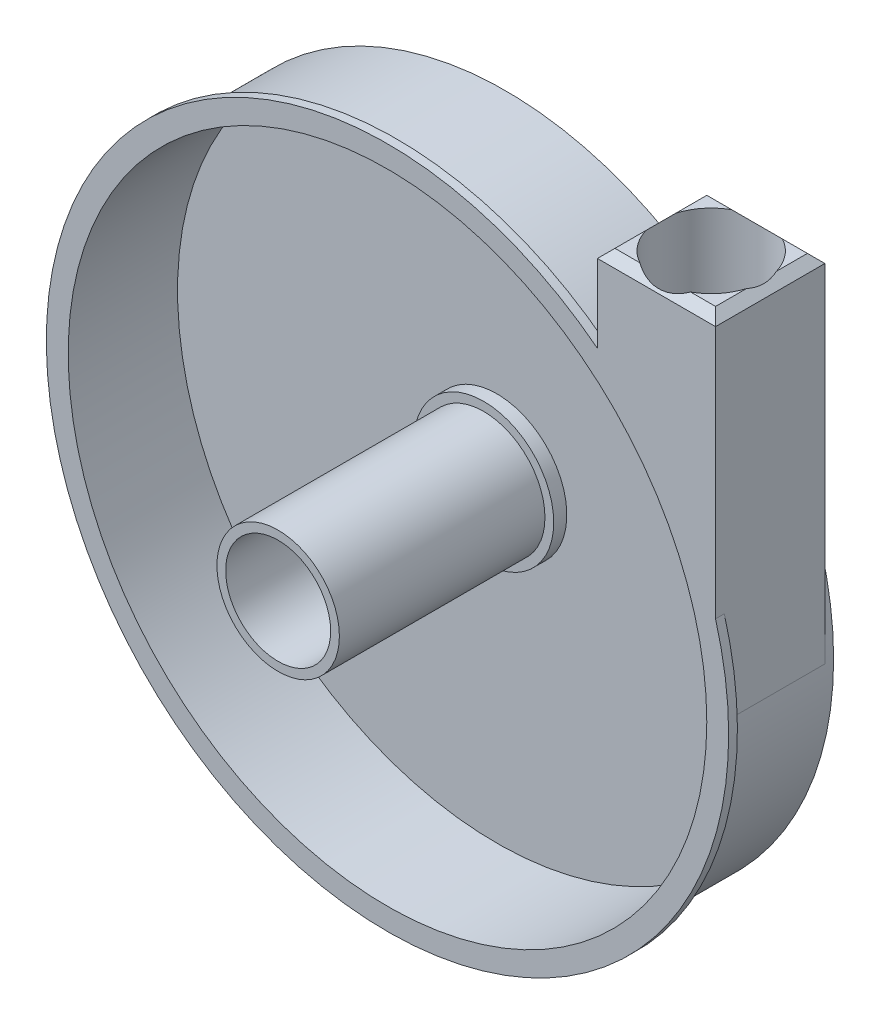
ISO-10303-21;
HEADER;
FILE_DESCRIPTION(('STEP AP214'),'2;1');
FILE_NAME('part.step','',(''),(''),'','','');
FILE_SCHEMA(('AUTOMOTIVE_DESIGN { 1 0 10303 214 1 1 1 1 }'));
ENDSEC;
DATA;
#1=APPLICATION_CONTEXT('core data for automotive mechanical design processes');
#2=APPLICATION_PROTOCOL_DEFINITION('international standard','automotive_design',2000,#1);
#3=PRODUCT_CONTEXT('',#1,'mechanical');
#4=PRODUCT('Part','Part','',(#3));
#5=PRODUCT_RELATED_PRODUCT_CATEGORY('part','',(#4));
#6=PRODUCT_DEFINITION_FORMATION('','',#4);
#7=PRODUCT_DEFINITION_CONTEXT('part definition',#1,'design');
#8=PRODUCT_DEFINITION('design','',#6,#7);
#9=PRODUCT_DEFINITION_SHAPE('','',#8);
#10=(LENGTH_UNIT() NAMED_UNIT(*) SI_UNIT(.MILLI.,.METRE.));
#11=(NAMED_UNIT(*) PLANE_ANGLE_UNIT() SI_UNIT($,.RADIAN.));
#12=(NAMED_UNIT(*) SI_UNIT($,.STERADIAN.) SOLID_ANGLE_UNIT());
#13=UNCERTAINTY_MEASURE_WITH_UNIT(LENGTH_MEASURE(1.E-05),#10,'distance_accuracy_value','');
#14=(GEOMETRIC_REPRESENTATION_CONTEXT(3) GLOBAL_UNCERTAINTY_ASSIGNED_CONTEXT((#13)) GLOBAL_UNIT_ASSIGNED_CONTEXT((#10,
#11,#12)) REPRESENTATION_CONTEXT('',''));
#15=CARTESIAN_POINT('',(0.,0.,0.));
#16=DIRECTION('',(0.,0.,1.));
#17=DIRECTION('',(1.,0.,0.));
#18=AXIS2_PLACEMENT_3D('',#15,#16,#17);
#19=CARTESIAN_POINT('',(0.,0.,25.));
#20=DIRECTION('',(0.,0.,-1.));
#21=DIRECTION('',(-1.,0.,0.));
#22=AXIS2_PLACEMENT_3D('',#19,#20,#21);
#23=CYLINDRICAL_SURFACE('',#22,75.);
#24=CARTESIAN_POINT('',(0.,0.,-2.));
#25=DIRECTION('',(0.,0.,-1.));
#26=DIRECTION('',(-1.,0.,0.));
#27=AXIS2_PLACEMENT_3D('',#24,#25,#26);
#28=CIRCLE('',#27,75.);
#29=CARTESIAN_POINT('',(-75.,0.,-2.));
#30=VERTEX_POINT('',#29);
#31=EDGE_CURVE('E477',#30,#30,#28,.T.);
#32=ORIENTED_EDGE('',*,*,#31,.F.);
#33=EDGE_LOOP('',(#32));
#34=FACE_BOUND('',#33,.T.);
#35=CARTESIAN_POINT('',(0.,0.,23.));
#36=DIRECTION('',(0.,0.,1.));
#37=DIRECTION('',(1.,0.,0.));
#38=AXIS2_PLACEMENT_3D('',#35,#36,#37);
#39=CIRCLE('',#38,75.);
#40=CARTESIAN_POINT('',(48.,57.6281181368957,23.));
#41=VERTEX_POINT('',#40);
#42=CARTESIAN_POINT('',(75.,0.,23.));
#43=VERTEX_POINT('',#42);
#44=EDGE_CURVE('E149',#41,#43,#39,.T.);
#45=ORIENTED_EDGE('',*,*,#44,.F.);
#46=DIRECTION('',(0.,0.,1.));
#47=VECTOR('',#46,1.);
#48=CARTESIAN_POINT('',(48.,57.6281181368956,-85.6539428203754));
#49=LINE('',#48,#47);
#50=CARTESIAN_POINT('',(48.,57.6281181368956,0.));
#51=VERTEX_POINT('',#50);
#52=EDGE_CURVE('E179',#51,#41,#49,.T.);
#53=ORIENTED_EDGE('',*,*,#52,.F.);
#54=CARTESIAN_POINT('',(0.,0.,0.));
#55=DIRECTION('',(0.,0.,-1.));
#56=DIRECTION('',(-1.,0.,0.));
#57=AXIS2_PLACEMENT_3D('',#54,#55,#56);
#58=CIRCLE('',#57,75.);
#59=CARTESIAN_POINT('',(75.,0.,0.));
#60=VERTEX_POINT('',#59);
#61=EDGE_CURVE('E176',#51,#60,#58,.T.);
#62=ORIENTED_EDGE('',*,*,#61,.T.);
#63=DIRECTION('',(0.,0.,1.));
#64=VECTOR('',#63,1.);
#65=CARTESIAN_POINT('',(75.,0.,-85.6539428203754));
#66=LINE('',#65,#64);
#67=EDGE_CURVE('E169',#60,#43,#66,.T.);
#68=ORIENTED_EDGE('',*,*,#67,.T.);
#69=EDGE_LOOP('',(#45,#53,#62,#68));
#70=FACE_BOUND('',#69,.T.);
#71=ADVANCED_FACE('F41',(#34,#70),#23,.T.);
#72=CARTESIAN_POINT('',(0.,0.,0.));
#73=DIRECTION('',(0.,0.,-1.));
#74=DIRECTION('',(-1.,0.,0.));
#75=AXIS2_PLACEMENT_3D('',#72,#73,#74);
#76=PLANE('',#75);
#77=CARTESIAN_POINT('',(0.,0.,0.));
#78=DIRECTION('',(0.,0.,1.));
#79=DIRECTION('',(1.,0.,0.));
#80=AXIS2_PLACEMENT_3D('',#77,#78,#79);
#81=CIRCLE('',#80,73.);
#82=CARTESIAN_POINT('',(73.,0.,0.));
#83=VERTEX_POINT('',#82);
#84=EDGE_CURVE('E196',#83,#83,#81,.T.);
#85=ORIENTED_EDGE('',*,*,#84,.T.);
#86=EDGE_LOOP('',(#85));
#87=FACE_BOUND('',#86,.T.);
#88=CARTESIAN_POINT('',(0.,0.,0.));
#89=DIRECTION('',(0.,0.,-1.));
#90=DIRECTION('',(-1.,0.,0.));
#91=AXIS2_PLACEMENT_3D('',#88,#89,#90);
#92=CIRCLE('',#91,16.);
#93=CARTESIAN_POINT('',(-16.,0.,0.));
#94=VERTEX_POINT('',#93);
#95=EDGE_CURVE('E254',#94,#94,#92,.F.);
#96=ORIENTED_EDGE('',*,*,#95,.F.);
#97=EDGE_LOOP('',(#96));
#98=FACE_BOUND('',#97,.T.);
#99=ADVANCED_FACE('F328',(#87,#98),#76,.F.);
#100=CARTESIAN_POINT('',(0.,81.287132565223,-85.6539428203754));
#101=DIRECTION('',(0.,1.,0.));
#102=DIRECTION('',(0.,0.,1.));
#103=AXIS2_PLACEMENT_3D('',#100,#101,#102);
#104=PLANE('',#103);
#105=CARTESIAN_POINT('',(61.5,81.287132565223,12.5));
#106=DIRECTION('',(0.,1.,0.));
#107=DIRECTION('',(0.,0.,1.));
#108=AXIS2_PLACEMENT_3D('',#105,#106,#107);
#109=CIRCLE('',#108,12.);
#110=CARTESIAN_POINT('',(67.3094750193112,81.287132565223,23.));
#111=VERTEX_POINT('',#110);
#112=CARTESIAN_POINT('',(73.,81.287132565223,15.9278273002006));
#113=VERTEX_POINT('',#112);
#114=EDGE_CURVE('E377',#111,#113,#109,.T.);
#115=ORIENTED_EDGE('',*,*,#114,.F.);
#116=DIRECTION('',(1.,0.,0.));
#117=VECTOR('',#116,1.);
#118=CARTESIAN_POINT('',(0.,81.287132565223,23.));
#119=LINE('',#118,#117);
#120=CARTESIAN_POINT('',(73.,81.287132565223,23.));
#121=VERTEX_POINT('',#120);
#122=EDGE_CURVE('E229',#111,#121,#119,.T.);
#123=ORIENTED_EDGE('',*,*,#122,.T.);
#124=DIRECTION('',(0.,0.,-1.));
#125=VECTOR('',#124,1.);
#126=CARTESIAN_POINT('',(73.,81.287132565223,-85.6539428203754));
#127=LINE('',#126,#125);
#128=EDGE_CURVE('E226',#121,#113,#127,.T.);
#129=ORIENTED_EDGE('',*,*,#128,.T.);
#130=EDGE_LOOP('',(#115,#123,#129));
#131=FACE_BOUND('',#130,.T.);
#132=ADVANCED_FACE('F330',(#131),#104,.T.);
#133=CARTESIAN_POINT('',(73.,81.287132565223,9.07217269979941));
#134=VERTEX_POINT('',#133);
#135=CARTESIAN_POINT('',(67.3094750193112,81.287132565223,2.00000000000003));
#136=VERTEX_POINT('',#135);
#137=EDGE_CURVE('E374',#134,#136,#109,.T.);
#138=ORIENTED_EDGE('',*,*,#137,.F.);
#139=DIRECTION('',(0.,0.,-1.));
#140=VECTOR('',#139,1.);
#141=CARTESIAN_POINT('',(73.,81.287132565223,-85.6539428203754));
#142=LINE('',#141,#140);
#143=CARTESIAN_POINT('',(73.,81.287132565223,2.00000000000003));
#144=VERTEX_POINT('',#143);
#145=EDGE_CURVE('E223',#134,#144,#142,.T.);
#146=ORIENTED_EDGE('',*,*,#145,.T.);
#147=DIRECTION('',(-1.,0.,0.));
#148=VECTOR('',#147,1.);
#149=CARTESIAN_POINT('',(48.,81.287132565223,2.00000000000003));
#150=LINE('',#149,#148);
#151=EDGE_CURVE('E220',#144,#136,#150,.T.);
#152=ORIENTED_EDGE('',*,*,#151,.T.);
#153=EDGE_LOOP('',(#138,#146,#152));
#154=FACE_BOUND('',#153,.T.);
#155=ADVANCED_FACE('F379',(#154),#104,.T.);
#156=CARTESIAN_POINT('',(55.6905249806889,81.287132565223,2.00000000000003));
#157=VERTEX_POINT('',#156);
#158=CARTESIAN_POINT('',(50.,81.287132565223,9.07217269979938));
#159=VERTEX_POINT('',#158);
#160=EDGE_CURVE('E382',#157,#159,#109,.T.);
#161=ORIENTED_EDGE('',*,*,#160,.F.);
#162=DIRECTION('',(-1.,0.,0.));
#163=VECTOR('',#162,1.);
#164=CARTESIAN_POINT('',(48.,81.287132565223,2.00000000000003));
#165=LINE('',#164,#163);
#166=CARTESIAN_POINT('',(50.,81.287132565223,2.00000000000003));
#167=VERTEX_POINT('',#166);
#168=EDGE_CURVE('E217',#157,#167,#165,.T.);
#169=ORIENTED_EDGE('',*,*,#168,.T.);
#170=DIRECTION('',(0.,0.,1.));
#171=VECTOR('',#170,1.);
#172=CARTESIAN_POINT('',(50.,81.287132565223,-85.6539428203754));
#173=LINE('',#172,#171);
#174=EDGE_CURVE('E214',#167,#159,#173,.T.);
#175=ORIENTED_EDGE('',*,*,#174,.T.);
#176=EDGE_LOOP('',(#161,#169,#175));
#177=FACE_BOUND('',#176,.T.);
#178=ADVANCED_FACE('F414',(#177),#104,.T.);
#179=CARTESIAN_POINT('',(0.,0.,0.));
#180=DIRECTION('',(0.,0.,1.));
#181=DIRECTION('',(1.,0.,0.));
#182=AXIS2_PLACEMENT_3D('',#179,#180,#181);
#183=PLANE('',#182);
#184=DIRECTION('',(0.,1.,0.));
#185=VECTOR('',#184,1.);
#186=CARTESIAN_POINT('',(48.,0.,0.));
#187=LINE('',#186,#185);
#188=CARTESIAN_POINT('',(48.,79.287132565223,0.));
#189=VERTEX_POINT('',#188);
#190=EDGE_CURVE('E178',#51,#189,#187,.T.);
#191=ORIENTED_EDGE('',*,*,#190,.T.);
#192=DIRECTION('',(1.,0.,0.));
#193=VECTOR('',#192,1.);
#194=CARTESIAN_POINT('',(75.,79.287132565223,0.));
#195=LINE('',#194,#193);
#196=CARTESIAN_POINT('',(75.,79.287132565223,0.));
#197=VERTEX_POINT('',#196);
#198=EDGE_CURVE('E248',#189,#197,#195,.T.);
#199=ORIENTED_EDGE('',*,*,#198,.T.);
#200=DIRECTION('',(0.,-1.,0.));
#201=VECTOR('',#200,1.);
#202=CARTESIAN_POINT('',(75.,0.,0.));
#203=LINE('',#202,#201);
#204=EDGE_CURVE('E184',#197,#60,#203,.T.);
#205=ORIENTED_EDGE('',*,*,#204,.T.);
#206=ORIENTED_EDGE('',*,*,#61,.F.);
#207=EDGE_LOOP('',(#191,#199,#205,#206));
#208=FACE_BOUND('',#207,.T.);
#209=ADVANCED_FACE('F350',(#208),#183,.F.);
#210=CARTESIAN_POINT('',(0.,0.,25.));
#211=DIRECTION('',(0.,0.,1.));
#212=DIRECTION('',(1.,0.,0.));
#213=AXIS2_PLACEMENT_3D('',#210,#211,#212);
#214=PLANE('',#213);
#215=DIRECTION('',(0.,-1.,0.));
#216=VECTOR('',#215,1.);
#217=CARTESIAN_POINT('',(48.,0.,25.));
#218=LINE('',#217,#216);
#219=CARTESIAN_POINT('',(48.,79.287132565223,25.));
#220=VERTEX_POINT('',#219);
#221=CARTESIAN_POINT('',(48.,61.4817045957576,25.));
#222=VERTEX_POINT('',#221);
#223=EDGE_CURVE('E186',#220,#222,#218,.T.);
#224=ORIENTED_EDGE('',*,*,#223,.T.);
#225=CARTESIAN_POINT('',(0.,0.,25.));
#226=DIRECTION('',(0.,0.,1.));
#227=DIRECTION('',(1.,0.,0.));
#228=AXIS2_PLACEMENT_3D('',#225,#226,#227);
#229=CIRCLE('',#228,78.);
#230=CARTESIAN_POINT('',(75.,21.4242852856285,25.));
#231=VERTEX_POINT('',#230);
#232=EDGE_CURVE('E427',#222,#231,#229,.T.);
#233=ORIENTED_EDGE('',*,*,#232,.T.);
#234=DIRECTION('',(0.,1.,0.));
#235=VECTOR('',#234,1.);
#236=CARTESIAN_POINT('',(75.,0.,25.));
#237=LINE('',#236,#235);
#238=CARTESIAN_POINT('',(75.,79.287132565223,25.));
#239=VERTEX_POINT('',#238);
#240=EDGE_CURVE('E400',#231,#239,#237,.T.);
#241=ORIENTED_EDGE('',*,*,#240,.T.);
#242=DIRECTION('',(-1.,0.,0.));
#243=VECTOR('',#242,1.);
#244=CARTESIAN_POINT('',(0.,79.287132565223,25.));
#245=LINE('',#244,#243);
#246=EDGE_CURVE('E203',#239,#220,#245,.T.);
#247=ORIENTED_EDGE('',*,*,#246,.T.);
#248=EDGE_LOOP('',(#224,#233,#241,#247));
#249=FACE_BOUND('',#248,.T.);
#250=CARTESIAN_POINT('',(0.,0.,25.));
#251=DIRECTION('',(0.,0.,1.));
#252=DIRECTION('',(1.,0.,0.));
#253=AXIS2_PLACEMENT_3D('',#250,#251,#252);
#254=CIRCLE('',#253,73.);
#255=CARTESIAN_POINT('',(73.,0.,25.));
#256=VERTEX_POINT('',#255);
#257=EDGE_CURVE('E191',#256,#256,#254,.T.);
#258=ORIENTED_EDGE('',*,*,#257,.F.);
#259=EDGE_LOOP('',(#258));
#260=FACE_BOUND('',#259,.T.);
#261=ADVANCED_FACE('F406',(#249,#260),#214,.T.);
#262=CARTESIAN_POINT('',(0.,0.,25.));
#263=DIRECTION('',(0.,0.,-1.));
#264=DIRECTION('',(-1.,0.,0.));
#265=AXIS2_PLACEMENT_3D('',#262,#263,#264);
#266=CYLINDRICAL_SURFACE('',#265,73.);
#267=CARTESIAN_POINT('',(72.9994353052816,0.287132565222961,15.9297212218552));
#268=CARTESIAN_POINT('',(72.9979623545784,0.663806934104672,15.9345067366003));
#269=CARTESIAN_POINT('',(72.993557989031,1.04024882143394,15.9494190264925));
#270=CARTESIAN_POINT('',(72.9789765964916,1.79156107458761,15.9977137855298));
#271=CARTESIAN_POINT('',(72.9688039513422,2.16643241596462,16.031082234081));
#272=CARTESIAN_POINT('',(72.9428270588969,2.91253767777489,16.1143474430268));
#273=CARTESIAN_POINT('',(72.9270460826385,3.28378021107746,16.1641758456484));
#274=CARTESIAN_POINT('',(72.8899563370081,4.02387367711012,16.277893798325));
#275=CARTESIAN_POINT('',(72.8686464545369,4.39272411291021,16.3417861793975));
#276=CARTESIAN_POINT('',(72.820654785672,5.12712381637103,16.480976076044));
#277=CARTESIAN_POINT('',(72.7939837884627,5.4926781976095,16.556250610957));
#278=CARTESIAN_POINT('',(72.7353347256226,6.22130715449342,16.7159804879053));
#279=CARTESIAN_POINT('',(72.7033569530296,6.58438186591319,16.8004353229198));
#280=CARTESIAN_POINT('',(72.6341155386217,7.30874916996467,16.976655464928));
#281=CARTESIAN_POINT('',(72.5968449253985,7.67003875131492,17.0684303424158));
#282=CARTESIAN_POINT('',(72.5170975476147,8.39058701297453,17.2575306441157));
#283=CARTESIAN_POINT('',(72.4746206322516,8.74984563414091,17.3548562290626));
#284=CARTESIAN_POINT('',(72.3763766428611,9.53109594464902,17.5715882391254));
#285=CARTESIAN_POINT('',(72.3195938168746,9.9527321485814,17.6918144152274));
#286=CARTESIAN_POINT('',(72.1988511863859,10.79381102947,17.9362862928151));
#287=CARTESIAN_POINT('',(72.1348911166455,11.2132536247606,18.0605321427287));
#288=CARTESIAN_POINT('',(71.9322478494693,12.4687959897805,18.4371093733769));
#289=CARTESIAN_POINT('',(71.782810877147,13.3020366610466,18.6932594243371));
#290=CARTESIAN_POINT('',(71.4551850270377,14.9623672655885,19.2072646666141));
#291=CARTESIAN_POINT('',(71.2769935931401,15.7894566452051,19.4651200075654));
#292=CARTESIAN_POINT('',(70.8916616201991,17.4381444544944,19.9765785529661));
#293=CARTESIAN_POINT('',(70.684522998023,18.2597432439794,20.2301820377268));
#294=CARTESIAN_POINT('',(70.2408702822514,19.8982641594154,20.7285232933919));
#295=CARTESIAN_POINT('',(70.0043389422201,20.7151832426535,20.9732557493317));
#296=CARTESIAN_POINT('',(69.5016535075518,22.3438236038075,21.4494941272207));
#297=CARTESIAN_POINT('',(69.2354978672111,23.1555446081647,21.68099935806));
#298=CARTESIAN_POINT('',(68.6733819854494,24.7729527396381,22.1265869185349));
#299=CARTESIAN_POINT('',(68.3774374869043,25.5786428146153,22.3406783440059));
#300=CARTESIAN_POINT('',(67.7553567066215,27.1836765533818,22.7473707567304));
#301=CARTESIAN_POINT('',(67.4292246582026,27.9830210900124,22.9399747489222));
#302=CARTESIAN_POINT('',(66.7553654684043,29.5538912351213,23.2945500477443));
#303=CARTESIAN_POINT('',(66.4084189218094,30.3256002568256,23.4571868853214));
#304=CARTESIAN_POINT('',(65.6855748379605,31.8610286324541,23.7531547943765));
#305=CARTESIAN_POINT('',(65.309679651429,32.6247486294045,23.8864882420024));
#306=CARTESIAN_POINT('',(64.5282609015348,34.1443250189066,24.1187844105412));
#307=CARTESIAN_POINT('',(64.1226774218935,34.9001617842265,24.217675168606));
#308=CARTESIAN_POINT('',(63.2831222297531,36.4003446314635,24.3744618573506));
#309=CARTESIAN_POINT('',(62.8491511439961,37.1446909666185,24.4323586927614));
#310=CARTESIAN_POINT('',(61.9485973661347,38.6281410774016,24.5002159975148));
#311=CARTESIAN_POINT('',(61.4816836501149,39.3670724791358,24.5095880467641));
#312=CARTESIAN_POINT('',(60.521972374551,40.8271163135594,24.4697217585908));
#313=CARTESIAN_POINT('',(60.0291663226248,41.5482227844023,24.4204640751429));
#314=CARTESIAN_POINT('',(59.2748801242826,42.61075861857,24.2946327611171));
#315=CARTESIAN_POINT('',(59.0214338481456,42.9611028871416,24.2441762362654));
#316=CARTESIAN_POINT('',(58.5098929158181,43.6552190682644,24.1244697031501));
#317=CARTESIAN_POINT('',(58.2517979586251,43.9989905522346,24.0552184738142));
#318=CARTESIAN_POINT('',(57.7321495061798,44.6786499812628,23.8963611427403));
#319=CARTESIAN_POINT('',(57.4705993977819,45.0145448634009,23.8067737560361));
#320=CARTESIAN_POINT('',(56.9450373817584,45.6775830218953,23.6054708460519));
#321=CARTESIAN_POINT('',(56.6810260722328,46.0047283533907,23.493760571851));
#322=CARTESIAN_POINT('',(56.1611600452772,46.6378171740085,23.2506391715589));
#323=CARTESIAN_POINT('',(55.9053404738567,46.9441024120971,23.1200469471613));
#324=CARTESIAN_POINT('',(55.3944351685871,47.5458967515685,22.8347794655195));
#325=CARTESIAN_POINT('',(55.1393493694187,47.841406841318,22.6801064240177));
#326=CARTESIAN_POINT('',(54.6320078441517,48.4199516341489,22.3449531275386));
#327=CARTESIAN_POINT('',(54.3797517347332,48.7029880425521,22.1644764146821));
#328=CARTESIAN_POINT('',(53.8806101495341,49.2546254681173,21.7760375230621));
#329=CARTESIAN_POINT('',(53.6337240098569,49.5232282758328,21.5680787646945));
#330=CARTESIAN_POINT('',(53.1844758501748,50.0050337421129,21.1562472803456));
#331=CARTESIAN_POINT('',(52.9809446386921,50.2205415112727,20.9563502222546));
#332=CARTESIAN_POINT('',(52.5823018569389,50.6377798573854,20.53484825536));
#333=CARTESIAN_POINT('',(52.3871902492077,50.8395104956381,20.3132434431533));
#334=CARTESIAN_POINT('',(52.0082104612175,51.2271359200913,19.8481841077543));
#335=CARTESIAN_POINT('',(51.8243304322779,51.4130474788808,19.6047533032529));
#336=CARTESIAN_POINT('',(51.4705348044191,51.7672355976141,19.0958913528225));
#337=CARTESIAN_POINT('',(51.3006158355063,51.9355164160727,18.8304655474168));
#338=CARTESIAN_POINT('',(51.0120316236897,52.2188134267297,18.3366211991729));
#339=CARTESIAN_POINT('',(50.8901233485062,52.3375707454242,18.1122350989594));
#340=CARTESIAN_POINT('',(50.6586075464004,52.5616916621282,17.6508060044906));
#341=CARTESIAN_POINT('',(50.5489974049612,52.6670581075994,17.4137657163217));
#342=CARTESIAN_POINT('',(50.3437232600079,52.863311535163,16.9279793249023));
#343=CARTESIAN_POINT('',(50.2480563792676,52.9542015048721,16.6792356507281));
#344=CARTESIAN_POINT('',(50.0722277077878,53.1204919931516,16.1712730020917));
#345=CARTESIAN_POINT('',(49.9920661953874,53.1958922336652,15.9120538396833));
#346=CARTESIAN_POINT('',(49.8482511929743,53.330682030288,15.3831113051095));
#347=CARTESIAN_POINT('',(49.7847057743736,53.3899668654864,15.1133316781626));
#348=CARTESIAN_POINT('',(49.6760527335307,53.491076903004,14.5668510080892));
#349=CARTESIAN_POINT('',(49.6309452947987,53.5329019315485,14.2901498961033));
#350=CARTESIAN_POINT('',(49.5601260722973,53.5984723760795,13.7322526854027));
#351=CARTESIAN_POINT('',(49.5344072704638,53.6222243339665,13.4510582507995));
#352=CARTESIAN_POINT('',(49.5029004324248,53.6513123980291,12.8866180471154));
#353=CARTESIAN_POINT('',(49.4971104847769,53.656650270361,12.6033724773771));
#354=CARTESIAN_POINT('',(49.5051353586005,53.6492457693232,12.0669920847395));
#355=CARTESIAN_POINT('',(49.5169681722762,53.6383312970409,11.8137983356879));
#356=CARTESIAN_POINT('',(49.5565007919967,53.6018092632366,11.309738875332));
#357=CARTESIAN_POINT('',(49.5841992667029,53.5762029345553,11.0588729704854));
#358=CARTESIAN_POINT('',(49.654980424146,53.5106086450689,10.5612722641213));
#359=CARTESIAN_POINT('',(49.6980610687068,53.4706225896088,10.3145369198263));
#360=CARTESIAN_POINT('',(49.7988915411415,53.3767284367912,9.82678389991519));
#361=CARTESIAN_POINT('',(49.8566418547575,53.322819878431,9.58576641391775));
#362=CARTESIAN_POINT('',(49.9857782003499,53.2017836533668,9.1113381178515));
#363=CARTESIAN_POINT('',(50.0571385989099,53.134680829679,8.87791395870897));
#364=CARTESIAN_POINT('',(50.2125098856327,52.9878784722421,8.41941637529763));
#365=CARTESIAN_POINT('',(50.2965203495845,52.9081793608961,8.19434267131752));
#366=CARTESIAN_POINT('',(50.4760715163579,52.7369091608894,7.75345717333551));
#367=CARTESIAN_POINT('',(50.5716147373258,52.6453354791231,7.53764741608669));
#368=CARTESIAN_POINT('',(50.7730365011621,52.451104352862,7.11605517724214));
#369=CARTESIAN_POINT('',(50.8789170094949,52.3484448001768,6.91027461372621));
#370=CARTESIAN_POINT('',(51.1412982240893,52.0923470756701,6.43399749323181));
#371=CARTESIAN_POINT('',(51.3018819944526,51.9343125858745,6.16820164192052));
#372=CARTESIAN_POINT('',(51.6373367815585,51.6007888908869,5.65738919763878));
#373=CARTESIAN_POINT('',(51.8122119442713,51.4252946173334,5.41237867686047));
#374=CARTESIAN_POINT('',(52.1736933132264,51.0585163375075,4.94302500549039));
#375=CARTESIAN_POINT('',(52.3603165996102,50.8672092089563,4.7187131724739));
#376=CARTESIAN_POINT('',(52.7425086388959,50.4708198171261,4.29094175435681));
#377=CARTESIAN_POINT('',(52.938077775884,50.2657369622151,4.08748306579416));
#378=CARTESIAN_POINT('',(53.4126922630554,49.7618895878729,3.62626258688685));
#379=CARTESIAN_POINT('',(53.6948439072518,49.4574979740323,3.37781854993759));
#380=CARTESIAN_POINT('',(54.2670512796545,48.8289669528083,2.91775941394701));
#381=CARTESIAN_POINT('',(54.5571099591988,48.5048201143305,2.70615829055899));
#382=CARTESIAN_POINT('',(55.1413684335768,47.8395821019823,2.31711717688576));
#383=CARTESIAN_POINT('',(55.4355721646841,47.4984739173713,2.13971238870259));
#384=CARTESIAN_POINT('',(56.0246352907974,46.8022267904353,1.81668554247675));
#385=CARTESIAN_POINT('',(56.3194946875645,46.4470878103832,1.67106356990111));
#386=CARTESIAN_POINT('',(57.0678474842381,45.5277703222134,1.33739794829745));
#387=CARTESIAN_POINT('',(57.5201357214306,44.9552380443025,1.16954506099203));
#388=CARTESIAN_POINT('',(58.4139035906502,43.7876407112064,0.894191082713178));
#389=CARTESIAN_POINT('',(58.8553771848215,43.1925635208536,0.786723002017829));
#390=CARTESIAN_POINT('',(59.7239134072505,41.9834415799095,0.623929214196303));
#391=CARTESIAN_POINT('',(60.1509466382289,41.3693625009542,0.568704345382002));
#392=CARTESIAN_POINT('',(60.9868629187308,40.1268404518286,0.503649578122868));
#393=CARTESIAN_POINT('',(61.3957473053872,39.4983985450385,0.493816329891645));
#394=CARTESIAN_POINT('',(62.1309465456162,38.3294222680677,0.51188131542227));
#395=CARTESIAN_POINT('',(62.4601421250109,37.7905866667416,0.534094989139765));
#396=CARTESIAN_POINT('',(63.1038105112625,36.7056803428101,0.603253295591105));
#397=CARTESIAN_POINT('',(63.4182812086459,36.1596085978507,0.650201460034808));
#398=CARTESIAN_POINT('',(64.0321945729446,35.0610079624042,0.766048512838429));
#399=CARTESIAN_POINT('',(64.3316285851002,34.5084755738405,0.834959878802614));
#400=CARTESIAN_POINT('',(64.9150265743604,33.3980935494094,0.992226323138219));
#401=CARTESIAN_POINT('',(65.1989911653454,32.8402441255741,1.080580629244));
#402=CARTESIAN_POINT('',(65.7518356078692,31.7188835685432,1.27467706937504));
#403=CARTESIAN_POINT('',(66.0206880838918,31.1553642109797,1.38044947576796));
#404=CARTESIAN_POINT('',(66.5427569843527,30.0241505929824,1.60726944245423));
#405=CARTESIAN_POINT('',(66.7959721667178,29.4564560049067,1.72831821383387));
#406=CARTESIAN_POINT('',(67.5320202223804,27.7482146950542,2.11150170611514));
#407=CARTESIAN_POINT('',(67.9914844401268,26.6020454251084,2.39375708995405));
#408=CARTESIAN_POINT('',(68.9736319296382,23.961634190412,3.08705360362591));
#409=CARTESIAN_POINT('',(69.4757145077455,22.4633018129781,3.51165411544201));
#410=CARTESIAN_POINT('',(70.1532349041519,20.2025468087671,4.18000932969927));
#411=CARTESIAN_POINT('',(70.3665296152482,19.4465126286501,4.40811347206598));
#412=CARTESIAN_POINT('',(70.6677391551907,18.3091349512648,4.75557892637469));
#413=CARTESIAN_POINT('',(70.7650188560919,17.9294606925102,4.87228372900042));
#414=CARTESIAN_POINT('',(70.9533673367785,17.1689582873978,5.10699663645152));
#415=CARTESIAN_POINT('',(71.0444357954899,16.7881300824508,5.22500480828535));
#416=CARTESIAN_POINT('',(71.3073980680762,15.6480439159891,5.57894932838104));
#417=CARTESIAN_POINT('',(71.4701487315967,14.8870280300737,5.81608635436224));
#418=CARTESIAN_POINT('',(71.7713211467297,13.3597648338045,6.28884105315759));
#419=CARTESIAN_POINT('',(71.9097432939349,12.5935176087253,6.52445875061667));
#420=CARTESIAN_POINT('',(72.1622858425987,11.0549584621849,6.9877395328838));
#421=CARTESIAN_POINT('',(72.2764171605722,10.2826494274495,7.21540615236021));
#422=CARTESIAN_POINT('',(72.429356333638,9.11819311464569,7.54380528079658));
#423=CARTESIAN_POINT('',(72.4772896541067,8.72907693994995,7.65107927046843));
#424=CARTESIAN_POINT('',(72.5670394615342,7.94853054411203,7.85958177118245));
#425=CARTESIAN_POINT('',(72.6088562428207,7.55710043525995,7.96081057298004));
#426=CARTESIAN_POINT('',(72.6752281147821,6.88407740596897,8.12737307663764));
#427=CARTESIAN_POINT('',(72.7012974545598,6.6031252506775,8.19468556598171));
#428=CARTESIAN_POINT('',(72.7502623636719,6.03980741719247,8.3243084941779));
#429=CARTESIAN_POINT('',(72.7731579737188,5.75744175717947,8.38661899719108));
#430=CARTESIAN_POINT('',(72.8369981871206,4.90851771825594,8.56448329692025));
#431=CARTESIAN_POINT('',(72.87314662087,4.33962231092209,8.67109966799172));
#432=CARTESIAN_POINT('',(72.9175460845013,3.48054930013449,8.80650045437293));
#433=CARTESIAN_POINT('',(72.930728236347,3.1925458382968,8.84761499300993));
#434=CARTESIAN_POINT('',(72.9537120786129,2.61521397018282,8.92034576965405));
#435=CARTESIAN_POINT('',(72.9635140611093,2.32588568057348,8.95196282829627));
#436=CARTESIAN_POINT('',(72.9797104192083,1.74538299926675,9.00471049685434));
#437=CARTESIAN_POINT('',(72.9860955635433,1.45420573567639,9.02581268829577));
#438=CARTESIAN_POINT('',(72.995385956967,0.871101379310836,9.05670893816146));
#439=CARTESIAN_POINT('',(72.9982900194794,0.57917406483052,9.06649914069229));
#440=CARTESIAN_POINT('',(72.9994353052816,0.287132565222955,9.07027877814478));
#441=B_SPLINE_CURVE_WITH_KNOTS('',3,(#267,#268,#269,#270,#271,#272,#273,#274,#275,#276,#277,
#278,#279,#280,#281,#282,#283,#284,#285,#286,#287,#288,#289,#290,#291,#292,#293,#294,#295,#296,
#297,#298,#299,#300,#301,#302,#303,#304,#305,#306,#307,#308,#309,#310,#311,#312,#313,#314,#315,
#316,#317,#318,#319,#320,#321,#322,#323,#324,#325,#326,#327,#328,#329,#330,#331,#332,#333,#334,
#335,#336,#337,#338,#339,#340,#341,#342,#343,#344,#345,#346,#347,#348,#349,#350,#351,#352,#353,
#354,#355,#356,#357,#358,#359,#360,#361,#362,#363,#364,#365,#366,#367,#368,#369,#370,#371,#372,
#373,#374,#375,#376,#377,#378,#379,#380,#381,#382,#383,#384,#385,#386,#387,#388,#389,#390,#391,
#392,#393,#394,#395,#396,#397,#398,#399,#400,#401,#402,#403,#404,#405,#406,#407,#408,#409,#410,
#411,#412,#413,#414,#415,#416,#417,#418,#419,#420,#421,#422,#423,#424,#425,#426,#427,#428,#429,
#430,#431,#432,#433,#434,#435,#436,#437,#438,#439,#440),.UNSPECIFIED.,.F.,.F.,(4,2,2,2,2,2,2,2,
2,2,2,2,2,2,2,2,2,2,2,2,2,2,2,2,2,2,2,2,2,2,2,2,2,2,2,2,2,2,2,2,2,2,2,2,2,2,2,2,2,2,2,2,2,2,2,2,
2,2,2,2,2,2,2,2,2,2,2,2,2,2,2,2,2,2,2,2,2,2,2,2,2,2,2,2,2,2,4),(0.,1.12984317022894,
2.2588292087885,3.38318433697665,4.50776600024546,5.6301067151926,6.75238547559685,
7.87615638504703,8.99995985264046,10.3261737201317,11.6524366145864,14.3051937925699,
16.9581869158452,19.6110044425119,22.2653859488273,24.9199060174657,27.5730305129477,
30.2257835124047,32.8096573608158,35.3933216111727,37.9823521068607,40.5713254611679,
43.1916208481126,45.8127810924365,47.1184136693519,48.4241310921677,49.7286517214267,
51.0328631982005,52.2917818230267,53.5505846796665,54.8092149035733,56.067688626527,
57.1393557087631,58.2110180224332,59.2815295394875,60.3517818870295,61.1958695793147,
62.0397774817352,62.8835109943741,63.7272596515841,64.5763667461856,65.4254822916068,
66.2742903366902,67.123016967509,67.8832114335602,68.6433421185853,69.4033721217376,
70.1634272942788,70.9220648578446,71.6806769866963,72.4394550571009,73.1983776786314,
74.2421612252354,75.2862486584499,76.3318907692336,77.3775778164042,78.8265357387801,
80.2760421037713,81.7270327306767,83.1780272593868,85.4205270856008,87.6642516189169,
89.9122981398934,92.1601787580899,94.0549411570019,95.9499741725773,97.8460857079204,
99.7421219440769,101.641488928358,103.541006586183,107.338470416693,112.242659993143,
114.696298041971,115.923078237829,117.149921800908,119.590156325689,122.030351167479,
124.469447037453,125.688779038221,126.908052345464,127.778220713624,128.648377918247,
130.387107630877,131.260631277512,132.134079425122,133.009875602666,133.885970222988),.UNSPECIFIED.);
#442=CARTESIAN_POINT('',(72.9994353052816,0.287132565222961,15.9297212218552));
#443=VERTEX_POINT('',#442);
#444=CARTESIAN_POINT('',(72.9994353052816,0.287132565222961,9.0702787781448));
#445=VERTEX_POINT('',#444);
#446=EDGE_CURVE('E392',#443,#445,#441,.T.);
#447=ORIENTED_EDGE('',*,*,#446,.F.);
#448=DIRECTION('',(0.,0.,-1.));
#449=VECTOR('',#448,1.);
#450=CARTESIAN_POINT('',(72.9994353052816,0.287132565222961,25.));
#451=LINE('',#450,#449);
#452=EDGE_CURVE('E195',#443,#445,#451,.T.);
#453=ORIENTED_EDGE('',*,*,#452,.T.);
#454=EDGE_LOOP('',(#447,#453));
#455=FACE_BOUND('',#454,.T.);
#456=ORIENTED_EDGE('',*,*,#257,.T.);
#457=EDGE_LOOP('',(#456));
#458=FACE_BOUND('',#457,.T.);
#459=ORIENTED_EDGE('',*,*,#84,.F.);
#460=EDGE_LOOP('',(#459));
#461=FACE_BOUND('',#460,.T.);
#462=ADVANCED_FACE('F402',(#455,#458,#461),#266,.F.);
#463=CARTESIAN_POINT('',(75.,0.,-85.6539428203754));
#464=DIRECTION('',(1.,0.,0.));
#465=DIRECTION('',(0.,0.,-1.));
#466=AXIS2_PLACEMENT_3D('',#463,#464,#465);
#467=PLANE('',#466);
#468=DIRECTION('',(0.,0.,1.));
#469=VECTOR('',#468,1.);
#470=CARTESIAN_POINT('',(75.,21.4242852856285,23.));
#471=LINE('',#470,#469);
#472=CARTESIAN_POINT('',(75.,21.4242852856285,23.));
#473=VERTEX_POINT('',#472);
#474=EDGE_CURVE('E171',#473,#231,#471,.T.);
#475=ORIENTED_EDGE('',*,*,#474,.F.);
#476=DIRECTION('',(0.,-1.,0.));
#477=VECTOR('',#476,1.);
#478=CARTESIAN_POINT('',(75.,0.,23.));
#479=LINE('',#478,#477);
#480=EDGE_CURVE('E153',#473,#43,#479,.T.);
#481=ORIENTED_EDGE('',*,*,#480,.T.);
#482=ORIENTED_EDGE('',*,*,#67,.F.);
#483=ORIENTED_EDGE('',*,*,#204,.F.);
#484=DIRECTION('',(0.,0.,1.));
#485=VECTOR('',#484,1.);
#486=CARTESIAN_POINT('',(75.,79.287132565223,-85.6539428203754));
#487=LINE('',#486,#485);
#488=EDGE_CURVE('E244',#197,#239,#487,.T.);
#489=ORIENTED_EDGE('',*,*,#488,.T.);
#490=ORIENTED_EDGE('',*,*,#240,.F.);
#491=EDGE_LOOP('',(#475,#481,#482,#483,#489,#490));
#492=FACE_BOUND('',#491,.T.);
#493=ADVANCED_FACE('F167',(#492),#467,.T.);
#494=CARTESIAN_POINT('',(48.,0.,-85.6539428203754));
#495=DIRECTION('',(-1.,0.,0.));
#496=DIRECTION('',(0.,0.,1.));
#497=AXIS2_PLACEMENT_3D('',#494,#495,#496);
#498=PLANE('',#497);
#499=DIRECTION('',(0.,0.,1.));
#500=VECTOR('',#499,1.);
#501=CARTESIAN_POINT('',(48.,61.4817045957576,23.));
#502=LINE('',#501,#500);
#503=CARTESIAN_POINT('',(48.,61.4817045957576,23.));
#504=VERTEX_POINT('',#503);
#505=EDGE_CURVE('E173',#222,#504,#502,.F.);
#506=ORIENTED_EDGE('',*,*,#505,.F.);
#507=ORIENTED_EDGE('',*,*,#223,.F.);
#508=DIRECTION('',(0.,0.,-1.));
#509=VECTOR('',#508,1.);
#510=CARTESIAN_POINT('',(48.,79.287132565223,-85.6539428203754));
#511=LINE('',#510,#509);
#512=EDGE_CURVE('E251',#220,#189,#511,.T.);
#513=ORIENTED_EDGE('',*,*,#512,.T.);
#514=ORIENTED_EDGE('',*,*,#190,.F.);
#515=ORIENTED_EDGE('',*,*,#52,.T.);
#516=DIRECTION('',(0.,1.,0.));
#517=VECTOR('',#516,1.);
#518=CARTESIAN_POINT('',(48.,0.,23.));
#519=LINE('',#518,#517);
#520=EDGE_CURVE('E156',#41,#504,#519,.T.);
#521=ORIENTED_EDGE('',*,*,#520,.T.);
#522=EDGE_LOOP('',(#506,#507,#513,#514,#515,#521));
#523=FACE_BOUND('',#522,.T.);
#524=ADVANCED_FACE('F445',(#523),#498,.T.);
#525=DIRECTION('',(0.,0.,1.));
#526=VECTOR('',#525,1.);
#527=CARTESIAN_POINT('',(50.,81.287132565223,-85.6539428203754));
#528=LINE('',#527,#526);
#529=CARTESIAN_POINT('',(50.,81.287132565223,15.9278273002006));
#530=VERTEX_POINT('',#529);
#531=CARTESIAN_POINT('',(50.,81.287132565223,23.));
#532=VERTEX_POINT('',#531);
#533=EDGE_CURVE('E207',#530,#532,#528,.T.);
#534=ORIENTED_EDGE('',*,*,#533,.T.);
#535=DIRECTION('',(1.,0.,0.));
#536=VECTOR('',#535,1.);
#537=CARTESIAN_POINT('',(0.,81.287132565223,23.));
#538=LINE('',#537,#536);
#539=CARTESIAN_POINT('',(55.6905249806888,81.287132565223,23.));
#540=VERTEX_POINT('',#539);
#541=EDGE_CURVE('E210',#532,#540,#538,.T.);
#542=ORIENTED_EDGE('',*,*,#541,.T.);
#543=EDGE_CURVE('E387',#530,#540,#109,.T.);
#544=ORIENTED_EDGE('',*,*,#543,.F.);
#545=EDGE_LOOP('',(#534,#542,#544));
#546=FACE_BOUND('',#545,.T.);
#547=ADVANCED_FACE('F339',(#546),#104,.T.);
#548=CARTESIAN_POINT('',(61.5,0.287132565222961,12.5));
#549=DIRECTION('',(0.,1.,0.));
#550=DIRECTION('',(0.,0.,1.));
#551=AXIS2_PLACEMENT_3D('',#548,#549,#550);
#552=CYLINDRICAL_SURFACE('',#551,12.);
#553=DIRECTION('',(0.,1.,0.));
#554=VECTOR('',#553,1.);
#555=CARTESIAN_POINT('',(67.3094750193111,0.287132565222961,23.));
#556=LINE('',#555,#554);
#557=CARTESIAN_POINT('',(67.3094750193111,39.413634349356,23.));
#558=VERTEX_POINT('',#557);
#559=CARTESIAN_POINT('',(67.3094750193111,33.0822395346013,23.));
#560=VERTEX_POINT('',#559);
#561=EDGE_CURVE('E56',#558,#560,#556,.F.);
#562=ORIENTED_EDGE('',*,*,#561,.F.);
#563=CARTESIAN_POINT('',(67.3094750193111,39.413634349356,23.));
#564=CARTESIAN_POINT('',(67.057110802949,39.8446307209143,23.1395856717401));
#565=CARTESIAN_POINT('',(66.799338441708,40.2753381881529,23.2703657185595));
#566=CARTESIAN_POINT('',(66.2731131387164,41.1354880591835,23.513704592725));
#567=CARTESIAN_POINT('',(66.0046581842282,41.5649302080458,23.6262599658646));
#568=CARTESIAN_POINT('',(65.4565291801796,42.4229035494784,23.8327762701017));
#569=CARTESIAN_POINT('',(65.1768256936227,42.8514287806954,23.9266840005093));
#570=CARTESIAN_POINT('',(64.6071836797746,43.7055519370525,24.0945500417102));
#571=CARTESIAN_POINT('',(64.3172457862881,44.1311500415225,24.1685095854286));
#572=CARTESIAN_POINT('',(63.7381817989963,44.9632258619125,24.2930072623208));
#573=CARTESIAN_POINT('',(63.4494091673464,45.3698363276435,24.344298923253));
#574=CARTESIAN_POINT('',(62.8630895115786,46.1787992574287,24.4260050820216));
#575=CARTESIAN_POINT('',(62.565542916174,46.5811519282261,24.4564205981512));
#576=CARTESIAN_POINT('',(61.9625068295009,47.3803552268239,24.494885505437));
#577=CARTESIAN_POINT('',(61.657025448612,47.7772108826266,24.5029568923292));
#578=CARTESIAN_POINT('',(61.0386293525794,48.5647648750972,24.495113321806));
#579=CARTESIAN_POINT('',(60.7257157959858,48.9554641558487,24.4792020790342));
#580=CARTESIAN_POINT('',(60.0319977211374,49.8047704990776,24.4159009532569));
#581=CARTESIAN_POINT('',(59.6497962879123,50.2618518212863,24.3630044132058));
#582=CARTESIAN_POINT('',(58.8785233034907,51.1631818482851,24.2167342276716));
#583=CARTESIAN_POINT('',(58.4894557853474,51.6074377072104,24.1233836319759));
#584=CARTESIAN_POINT('',(57.698593446997,52.4902921553737,23.8895997474271));
#585=CARTESIAN_POINT('',(57.2967063853354,52.9285544470871,23.7481812605583));
#586=CARTESIAN_POINT('',(56.6937426429343,53.5715065198521,23.4976078465622));
#587=CARTESIAN_POINT('',(56.4925281416055,53.783625021339,23.4075647250769));
#588=CARTESIAN_POINT('',(56.09080938064,54.2024486753612,23.2140250129897));
#589=CARTESIAN_POINT('',(55.8903053473962,54.4091522167693,23.1105244717827));
#590=CARTESIAN_POINT('',(55.6905249806889,54.6128686975448,23.0000000000001));
#591=B_SPLINE_CURVE_WITH_KNOTS('',3,(#563,#564,#565,#566,#567,#568,#569,#570,#571,#572,#573,
#574,#575,#576,#577,#578,#579,#580,#581,#582,#583,#584,#585,#586,#587,#588,#589,#590),
.UNSPECIFIED.,.F.,.F.,(4,2,2,2,2,2,2,2,2,2,2,2,2,4),(0.,1.55568172543761,3.11165796214244,
4.67201147376648,6.23226852348871,7.73582026849447,9.23929866828539,10.7412965049622,
12.2430617227254,14.0360884691491,15.8280949307806,17.6592987757145,18.5767659241304,
19.4945030179484),.UNSPECIFIED.);
#592=CARTESIAN_POINT('',(55.6905249806889,54.6128686975448,23.));
#593=VERTEX_POINT('',#592);
#594=EDGE_CURVE('E11',#558,#593,#591,.T.);
#595=ORIENTED_EDGE('',*,*,#594,.T.);
#596=DIRECTION('',(0.,1.,0.));
#597=VECTOR('',#596,1.);
#598=CARTESIAN_POINT('',(55.6905249806889,0.287132565222961,23.));
#599=LINE('',#598,#597);
#600=CARTESIAN_POINT('',(55.6905249806889,50.2351015463816,23.));
#601=VERTEX_POINT('',#600);
#602=EDGE_CURVE('E284',#601,#593,#599,.T.);
#603=ORIENTED_EDGE('',*,*,#602,.F.);
#604=CARTESIAN_POINT('',(67.3094750193111,33.0822395346013,23.));
#605=CARTESIAN_POINT('',(67.0892972351824,33.5302232417627,23.1217980384295));
#606=CARTESIAN_POINT('',(66.8639681847475,33.9773750237715,23.2374449027803));
#607=CARTESIAN_POINT('',(66.4030069867061,34.869653442384,23.455623596125));
#608=CARTESIAN_POINT('',(66.1673731920217,35.3147797425951,23.5581533181597));
#609=CARTESIAN_POINT('',(65.6854367530234,36.2033054564648,23.7494184044812));
#610=CARTESIAN_POINT('',(65.4391155660915,36.6467002848337,23.838128459368));
#611=CARTESIAN_POINT('',(64.9363043456307,37.5304517422212,24.0005050620881));
#612=CARTESIAN_POINT('',(64.6798148107364,37.9708085189794,24.0741723465007));
#613=CARTESIAN_POINT('',(64.1646127413614,38.8348795609433,24.203343234747));
#614=CARTESIAN_POINT('',(63.9061952698965,39.2586981445805,24.259323517514));
#615=CARTESIAN_POINT('',(63.3801335243059,40.102441603377,24.3548117719382));
#616=CARTESIAN_POINT('',(63.1124895779298,40.5223666161755,24.3943203280646));
#617=CARTESIAN_POINT('',(62.5683757898215,41.3575459417175,24.4554796897715));
#618=CARTESIAN_POINT('',(62.2919097705352,41.7728021746613,24.4771381232294));
#619=CARTESIAN_POINT('',(61.7304960453883,42.5980627943774,24.5010746198091));
#620=CARTESIAN_POINT('',(61.4455489695337,43.0080675680283,24.5033541188864));
#621=CARTESIAN_POINT('',(60.7314862424606,44.0139250901744,24.4829203933583));
#622=CARTESIAN_POINT('',(60.2977167679106,44.6062972958273,24.4479219134255));
#623=CARTESIAN_POINT('',(59.4158133109871,45.774401512156,24.3259947937153));
#624=CARTESIAN_POINT('',(58.9676902796976,46.3501456002043,24.239104891711));
#625=CARTESIAN_POINT('',(58.2826687557686,47.2045344382985,24.063128859739));
#626=CARTESIAN_POINT('',(58.049592048418,47.490841028297,23.9958765874911));
#627=CARTESIAN_POINT('',(57.5814458934961,48.0573827359142,23.8448414000571));
#628=CARTESIAN_POINT('',(57.3463767054863,48.3376186279544,23.7610606073138));
#629=CARTESIAN_POINT('',(56.8744808348887,48.8919843893827,23.5756056226252));
#630=CARTESIAN_POINT('',(56.6376511557243,49.1660962569724,23.4738849399634));
#631=CARTESIAN_POINT('',(56.1638685471668,49.7066358448579,23.2514689010848));
#632=CARTESIAN_POINT('',(55.9269156128548,49.973059838535,23.1307645196778));
#633=CARTESIAN_POINT('',(55.6905249806889,50.2351015463816,23.));
#634=B_SPLINE_CURVE_WITH_KNOTS('',3,(#604,#605,#606,#607,#608,#609,#610,#611,#612,#613,#614,
#615,#616,#617,#618,#619,#620,#621,#622,#623,#624,#625,#626,#627,#628,#629,#630,#631,#632,#633),
.UNSPECIFIED.,.F.,.F.,(4,2,2,2,2,2,2,2,2,2,2,2,2,2,4),(0.,1.54140707413695,3.08306142890043,
4.62750679999986,6.17187652815639,7.67013197919961,9.16833426284584,10.6658959885763,
12.1633467458436,14.3665379848639,16.5680865588413,17.6935148189822,18.8187986557813,
19.9470426712212,21.0758247045675),.UNSPECIFIED.);
#635=EDGE_CURVE('E275',#560,#601,#634,.T.);
#636=ORIENTED_EDGE('',*,*,#635,.F.);
#637=EDGE_LOOP('',(#562,#595,#603,#636));
#638=FACE_BOUND('',#637,.T.);
#639=ORIENTED_EDGE('',*,*,#446,.T.);
#640=CARTESIAN_POINT('',(61.5,0.287132565222961,12.5));
#641=DIRECTION('',(0.,1.,0.));
#642=DIRECTION('',(0.,0.,1.));
#643=AXIS2_PLACEMENT_3D('',#640,#641,#642);
#644=CIRCLE('',#643,12.);
#645=EDGE_CURVE('E386',#443,#445,#644,.T.);
#646=ORIENTED_EDGE('',*,*,#645,.F.);
#647=EDGE_LOOP('',(#639,#646));
#648=FACE_BOUND('',#647,.T.);
#649=ORIENTED_EDGE('',*,*,#543,.T.);
#650=CARTESIAN_POINT('',(61.5,91.7871325652228,12.5));
#651=DIRECTION('',(0.,-0.707106781186551,-0.707106781186544));
#652=DIRECTION('',(0.,0.707106781186544,-0.707106781186551));
#653=AXIS2_PLACEMENT_3D('',#650,#651,#652);
#654=ELLIPSE('',#653,16.970562748477,12.);
#655=EDGE_CURVE('E241',#540,#111,#654,.F.);
#656=ORIENTED_EDGE('',*,*,#655,.T.);
#657=ORIENTED_EDGE('',*,*,#114,.T.);
#658=CARTESIAN_POINT('',(61.5,92.7871325652229,12.5));
#659=DIRECTION('',(-0.707106781186545,-0.70710678118655,0.));
#660=DIRECTION('',(-0.70710678118655,0.707106781186545,0.));
#661=AXIS2_PLACEMENT_3D('',#658,#659,#660);
#662=ELLIPSE('',#661,16.9705627484771,12.);
#663=EDGE_CURVE('E238',#113,#134,#662,.F.);
#664=ORIENTED_EDGE('',*,*,#663,.T.);
#665=ORIENTED_EDGE('',*,*,#137,.T.);
#666=CARTESIAN_POINT('',(61.5,91.7871325652229,12.5));
#667=DIRECTION('',(0.,0.70710678118655,-0.707106781186545));
#668=DIRECTION('',(0.,0.707106781186545,0.70710678118655));
#669=AXIS2_PLACEMENT_3D('',#666,#667,#668);
#670=ELLIPSE('',#669,16.9705627484771,12.);
#671=EDGE_CURVE('E235',#136,#157,#670,.T.);
#672=ORIENTED_EDGE('',*,*,#671,.T.);
#673=ORIENTED_EDGE('',*,*,#160,.T.);
#674=CARTESIAN_POINT('',(61.5,92.7871325652228,12.5));
#675=DIRECTION('',(0.707106781186544,-0.707106781186551,0.));
#676=DIRECTION('',(0.707106781186551,0.707106781186544,0.));
#677=AXIS2_PLACEMENT_3D('',#674,#675,#676);
#678=ELLIPSE('',#677,16.970562748477,12.);
#679=EDGE_CURVE('E232',#159,#530,#678,.F.);
#680=ORIENTED_EDGE('',*,*,#679,.T.);
#681=EDGE_LOOP('',(#649,#656,#657,#664,#665,#672,#673,#680));
#682=FACE_BOUND('',#681,.T.);
#683=ADVANCED_FACE('F285',(#638,#648,#682),#552,.F.);
#684=CARTESIAN_POINT('',(61.5,0.287132565222961,12.5));
#685=DIRECTION('',(0.,1.,0.));
#686=DIRECTION('',(0.,0.,1.));
#687=AXIS2_PLACEMENT_3D('',#684,#685,#686);
#688=PLANE('',#687);
#689=ORIENTED_EDGE('',*,*,#645,.T.);
#690=ORIENTED_EDGE('',*,*,#452,.F.);
#691=EDGE_LOOP('',(#689,#690));
#692=FACE_BOUND('',#691,.T.);
#693=ADVANCED_FACE('F326',(#692),#688,.T.);
#694=CARTESIAN_POINT('',(0.,0.,-2.));
#695=DIRECTION('',(0.,0.,-1.));
#696=DIRECTION('',(-1.,0.,0.));
#697=AXIS2_PLACEMENT_3D('',#694,#695,#696);
#698=PLANE('',#697);
#699=ORIENTED_EDGE('',*,*,#31,.T.);
#700=EDGE_LOOP('',(#699));
#701=FACE_BOUND('',#700,.T.);
#702=CARTESIAN_POINT('',(0.,0.,-2.));
#703=DIRECTION('',(0.,0.,-1.));
#704=DIRECTION('',(-1.,0.,0.));
#705=AXIS2_PLACEMENT_3D('',#702,#703,#704);
#706=CIRCLE('',#705,12.);
#707=CARTESIAN_POINT('',(-12.,0.,-2.));
#708=VERTEX_POINT('',#707);
#709=EDGE_CURVE('E271',#708,#708,#706,.T.);
#710=ORIENTED_EDGE('',*,*,#709,.F.);
#711=EDGE_LOOP('',(#710));
#712=FACE_BOUND('',#711,.T.);
#713=ADVANCED_FACE('F322',(#701,#712),#698,.T.);
#714=CARTESIAN_POINT('',(0.,0.,-2.));
#715=DIRECTION('',(0.,0.,1.));
#716=DIRECTION('',(1.,0.,0.));
#717=AXIS2_PLACEMENT_3D('',#714,#715,#716);
#718=CYLINDRICAL_SURFACE('',#717,12.);
#719=ORIENTED_EDGE('',*,*,#709,.T.);
#720=EDGE_LOOP('',(#719));
#721=FACE_BOUND('',#720,.T.);
#722=CARTESIAN_POINT('',(0.,0.,50.));
#723=DIRECTION('',(0.,0.,1.));
#724=DIRECTION('',(1.,0.,0.));
#725=AXIS2_PLACEMENT_3D('',#722,#723,#724);
#726=CIRCLE('',#725,12.);
#727=CARTESIAN_POINT('',(12.,0.,50.));
#728=VERTEX_POINT('',#727);
#729=EDGE_CURVE('E467',#728,#728,#726,.T.);
#730=ORIENTED_EDGE('',*,*,#729,.T.);
#731=EDGE_LOOP('',(#730));
#732=FACE_BOUND('',#731,.T.);
#733=ADVANCED_FACE('F319',(#721,#732),#718,.F.);
#734=CARTESIAN_POINT('',(0.,79.287132565223,0.));
#735=DIRECTION('',(0.,0.70710678118655,-0.707106781186545));
#736=DIRECTION('',(-1.,0.,0.));
#737=AXIS2_PLACEMENT_3D('',#734,#735,#736);
#738=PLANE('',#737);
#739=ORIENTED_EDGE('',*,*,#671,.F.);
#740=ORIENTED_EDGE('',*,*,#151,.F.);
#741=DIRECTION('',(-0.577350269189627,0.577350269189623,0.577350269189627));
#742=VECTOR('',#741,1.);
#743=CARTESIAN_POINT('',(49.9999999999999,104.287132565223,25.0000000000001));
#744=LINE('',#743,#742);
#745=EDGE_CURVE('E267',#197,#144,#744,.T.);
#746=ORIENTED_EDGE('',*,*,#745,.F.);
#747=ORIENTED_EDGE('',*,*,#198,.F.);
#748=DIRECTION('',(0.577350269189628,0.577350269189622,0.577350269189626));
#749=VECTOR('',#748,1.);
#750=CARTESIAN_POINT('',(20.7820190598747,52.069151625098,-27.2179809401252));
#751=LINE('',#750,#749);
#752=EDGE_CURVE('E263',#167,#189,#751,.F.);
#753=ORIENTED_EDGE('',*,*,#752,.F.);
#754=ORIENTED_EDGE('',*,*,#168,.F.);
#755=EDGE_LOOP('',(#739,#740,#746,#747,#753,#754));
#756=FACE_BOUND('',#755,.T.);
#757=ADVANCED_FACE('F43',(#756),#738,.T.);
#758=CARTESIAN_POINT('',(75.,79.287132565223,-85.6539428203754));
#759=DIRECTION('',(-0.707106781186545,-0.70710678118655,0.));
#760=DIRECTION('',(0.,0.,1.));
#761=AXIS2_PLACEMENT_3D('',#758,#759,#760);
#762=PLANE('',#761);
#763=ORIENTED_EDGE('',*,*,#663,.F.);
#764=ORIENTED_EDGE('',*,*,#128,.F.);
#765=DIRECTION('',(0.577350269189626,-0.577350269189622,0.577350269189628));
#766=VECTOR('',#765,1.);
#767=CARTESIAN_POINT('',(38.115352393208,116.171780172015,-11.8846476067921));
#768=LINE('',#767,#766);
#769=EDGE_CURVE('E258',#239,#121,#768,.F.);
#770=ORIENTED_EDGE('',*,*,#769,.F.);
#771=ORIENTED_EDGE('',*,*,#488,.F.);
#772=ORIENTED_EDGE('',*,*,#745,.T.);
#773=ORIENTED_EDGE('',*,*,#145,.F.);
#774=EDGE_LOOP('',(#763,#764,#770,#771,#772,#773));
#775=FACE_BOUND('',#774,.T.);
#776=ADVANCED_FACE('F357',(#775),#762,.F.);
#777=CARTESIAN_POINT('',(50.,81.287132565223,-85.6539428203754));
#778=DIRECTION('',(0.707106781186544,-0.707106781186551,0.));
#779=DIRECTION('',(0.,0.,1.));
#780=AXIS2_PLACEMENT_3D('',#777,#778,#779);
#781=PLANE('',#780);
#782=ORIENTED_EDGE('',*,*,#752,.T.);
#783=ORIENTED_EDGE('',*,*,#512,.F.);
#784=DIRECTION('',(0.577350269189628,0.577350269189622,-0.577350269189628));
#785=VECTOR('',#784,1.);
#786=CARTESIAN_POINT('',(86.2179809401254,117.505113505348,-13.2179809401254));
#787=LINE('',#786,#785);
#788=EDGE_CURVE('E255',#532,#220,#787,.F.);
#789=ORIENTED_EDGE('',*,*,#788,.F.);
#790=ORIENTED_EDGE('',*,*,#533,.F.);
#791=ORIENTED_EDGE('',*,*,#679,.F.);
#792=ORIENTED_EDGE('',*,*,#174,.F.);
#793=EDGE_LOOP('',(#782,#783,#789,#790,#791,#792));
#794=FACE_BOUND('',#793,.T.);
#795=ADVANCED_FACE('F354',(#794),#781,.F.);
#796=CARTESIAN_POINT('',(0.,79.287132565223,25.));
#797=DIRECTION('',(0.,-0.707106781186551,-0.707106781186544));
#798=DIRECTION('',(-1.,0.,0.));
#799=AXIS2_PLACEMENT_3D('',#796,#797,#798);
#800=PLANE('',#799);
#801=ORIENTED_EDGE('',*,*,#655,.F.);
#802=ORIENTED_EDGE('',*,*,#541,.F.);
#803=ORIENTED_EDGE('',*,*,#788,.T.);
#804=ORIENTED_EDGE('',*,*,#246,.F.);
#805=ORIENTED_EDGE('',*,*,#769,.T.);
#806=ORIENTED_EDGE('',*,*,#122,.F.);
#807=EDGE_LOOP('',(#801,#802,#803,#804,#805,#806));
#808=FACE_BOUND('',#807,.T.);
#809=ADVANCED_FACE('F314',(#808),#800,.F.);
#810=CARTESIAN_POINT('',(0.,0.,50.));
#811=DIRECTION('',(0.,0.,1.));
#812=DIRECTION('',(1.,0.,0.));
#813=AXIS2_PLACEMENT_3D('',#810,#811,#812);
#814=PLANE('',#813);
#815=CARTESIAN_POINT('',(0.,0.,50.));
#816=DIRECTION('',(0.,0.,1.));
#817=DIRECTION('',(1.,0.,0.));
#818=AXIS2_PLACEMENT_3D('',#815,#816,#817);
#819=CIRCLE('',#818,14.);
#820=CARTESIAN_POINT('',(14.,0.,50.));
#821=VERTEX_POINT('',#820);
#822=EDGE_CURVE('E259',#821,#821,#819,.T.);
#823=ORIENTED_EDGE('',*,*,#822,.T.);
#824=EDGE_LOOP('',(#823));
#825=FACE_BOUND('',#824,.T.);
#826=ORIENTED_EDGE('',*,*,#729,.F.);
#827=EDGE_LOOP('',(#826));
#828=FACE_BOUND('',#827,.T.);
#829=ADVANCED_FACE('F311',(#825,#828),#814,.T.);
#830=CARTESIAN_POINT('',(0.,0.,50.));
#831=DIRECTION('',(0.,0.,-1.));
#832=DIRECTION('',(-1.,0.,0.));
#833=AXIS2_PLACEMENT_3D('',#830,#831,#832);
#834=CYLINDRICAL_SURFACE('',#833,14.);
#835=CARTESIAN_POINT('',(0.,0.,3.));
#836=DIRECTION('',(0.,0.,1.));
#837=DIRECTION('',(1.,0.,0.));
#838=AXIS2_PLACEMENT_3D('',#835,#836,#837);
#839=CIRCLE('',#838,14.);
#840=CARTESIAN_POINT('',(14.,0.,3.));
#841=VERTEX_POINT('',#840);
#842=EDGE_CURVE('E459',#841,#841,#839,.T.);
#843=ORIENTED_EDGE('',*,*,#842,.T.);
#844=EDGE_LOOP('',(#843));
#845=FACE_BOUND('',#844,.T.);
#846=ORIENTED_EDGE('',*,*,#822,.F.);
#847=EDGE_LOOP('',(#846));
#848=FACE_BOUND('',#847,.T.);
#849=ADVANCED_FACE('F306',(#845,#848),#834,.T.);
#850=CARTESIAN_POINT('',(0.,0.,3.));
#851=DIRECTION('',(0.,0.,1.));
#852=DIRECTION('',(1.,0.,0.));
#853=AXIS2_PLACEMENT_3D('',#850,#851,#852);
#854=PLANE('',#853);
#855=CARTESIAN_POINT('',(0.,0.,3.));
#856=DIRECTION('',(0.,0.,1.));
#857=DIRECTION('',(1.,0.,0.));
#858=AXIS2_PLACEMENT_3D('',#855,#856,#857);
#859=CIRCLE('',#858,16.);
#860=CARTESIAN_POINT('',(16.,0.,3.));
#861=VERTEX_POINT('',#860);
#862=EDGE_CURVE('E463',#861,#861,#859,.T.);
#863=ORIENTED_EDGE('',*,*,#862,.T.);
#864=EDGE_LOOP('',(#863));
#865=FACE_BOUND('',#864,.T.);
#866=ORIENTED_EDGE('',*,*,#842,.F.);
#867=EDGE_LOOP('',(#866));
#868=FACE_BOUND('',#867,.T.);
#869=ADVANCED_FACE('F303',(#865,#868),#854,.T.);
#870=CARTESIAN_POINT('',(0.,0.,3.));
#871=DIRECTION('',(0.,0.,-1.));
#872=DIRECTION('',(-1.,0.,0.));
#873=AXIS2_PLACEMENT_3D('',#870,#871,#872);
#874=CYLINDRICAL_SURFACE('',#873,16.);
#875=ORIENTED_EDGE('',*,*,#862,.F.);
#876=EDGE_LOOP('',(#875));
#877=FACE_BOUND('',#876,.T.);
#878=ORIENTED_EDGE('',*,*,#95,.T.);
#879=EDGE_LOOP('',(#878));
#880=FACE_BOUND('',#879,.T.);
#881=ADVANCED_FACE('F294',(#877,#880),#874,.T.);
#882=CARTESIAN_POINT('',(0.,0.,23.));
#883=DIRECTION('',(0.,0.,1.));
#884=DIRECTION('',(1.,0.,0.));
#885=AXIS2_PLACEMENT_3D('',#882,#883,#884);
#886=CYLINDRICAL_SURFACE('',#885,75.);
#887=EDGE_CURVE('E162',#560,#601,#39,.T.);
#888=ORIENTED_EDGE('',*,*,#887,.F.);
#889=ORIENTED_EDGE('',*,*,#635,.T.);
#890=EDGE_LOOP('',(#888,#889));
#891=FACE_BOUND('',#890,.T.);
#892=ADVANCED_FACE('F289',(#891),#886,.F.);
#893=CARTESIAN_POINT('',(0.,0.,23.));
#894=DIRECTION('',(0.,0.,1.));
#895=DIRECTION('',(1.,0.,0.));
#896=AXIS2_PLACEMENT_3D('',#893,#894,#895);
#897=PLANE('',#896);
#898=CARTESIAN_POINT('',(0.,0.,23.));
#899=DIRECTION('',(0.,0.,1.));
#900=DIRECTION('',(1.,0.,0.));
#901=AXIS2_PLACEMENT_3D('',#898,#899,#900);
#902=CIRCLE('',#901,78.);
#903=EDGE_CURVE('E447',#558,#593,#902,.T.);
#904=ORIENTED_EDGE('',*,*,#903,.F.);
#905=ORIENTED_EDGE('',*,*,#561,.T.);
#906=ORIENTED_EDGE('',*,*,#887,.T.);
#907=ORIENTED_EDGE('',*,*,#602,.T.);
#908=EDGE_LOOP('',(#904,#905,#906,#907));
#909=FACE_BOUND('',#908,.T.);
#910=ADVANCED_FACE('F293',(#909),#897,.F.);
#911=CARTESIAN_POINT('',(0.,0.,23.));
#912=DIRECTION('',(0.,0.,1.));
#913=DIRECTION('',(1.,0.,0.));
#914=AXIS2_PLACEMENT_3D('',#911,#912,#913);
#915=CYLINDRICAL_SURFACE('',#914,78.);
#916=ORIENTED_EDGE('',*,*,#594,.F.);
#917=ORIENTED_EDGE('',*,*,#903,.T.);
#918=EDGE_LOOP('',(#916,#917));
#919=FACE_BOUND('',#918,.T.);
#920=ADVANCED_FACE('F301',(#919),#915,.T.);
#921=EDGE_CURVE('E451',#504,#473,#902,.T.);
#922=ORIENTED_EDGE('',*,*,#921,.T.);
#923=ORIENTED_EDGE('',*,*,#474,.T.);
#924=ORIENTED_EDGE('',*,*,#232,.F.);
#925=ORIENTED_EDGE('',*,*,#505,.T.);
#926=EDGE_LOOP('',(#922,#923,#924,#925));
#927=FACE_BOUND('',#926,.T.);
#928=ADVANCED_FACE('F297',(#927),#915,.T.);
#929=ORIENTED_EDGE('',*,*,#480,.F.);
#930=ORIENTED_EDGE('',*,*,#921,.F.);
#931=ORIENTED_EDGE('',*,*,#520,.F.);
#932=ORIENTED_EDGE('',*,*,#44,.T.);
#933=EDGE_LOOP('',(#929,#930,#931,#932));
#934=FACE_BOUND('',#933,.T.);
#935=ADVANCED_FACE('F151',(#934),#897,.F.);
#936=CLOSED_SHELL('',(#71,#99,#132,#155,#178,#209,#261,#462,#493,#524,#547,#683,#693,#713,#733,
#757,#776,#795,#809,#829,#849,#869,#881,#892,#910,#920,#928,#935));
#937=MANIFOLD_SOLID_BREP('B2',#936);
#938=ADVANCED_BREP_SHAPE_REPRESENTATION('',(#18,#937),#14);
#939=SHAPE_DEFINITION_REPRESENTATION(#9,#938);
ENDSEC;
END-ISO-10303-21;
